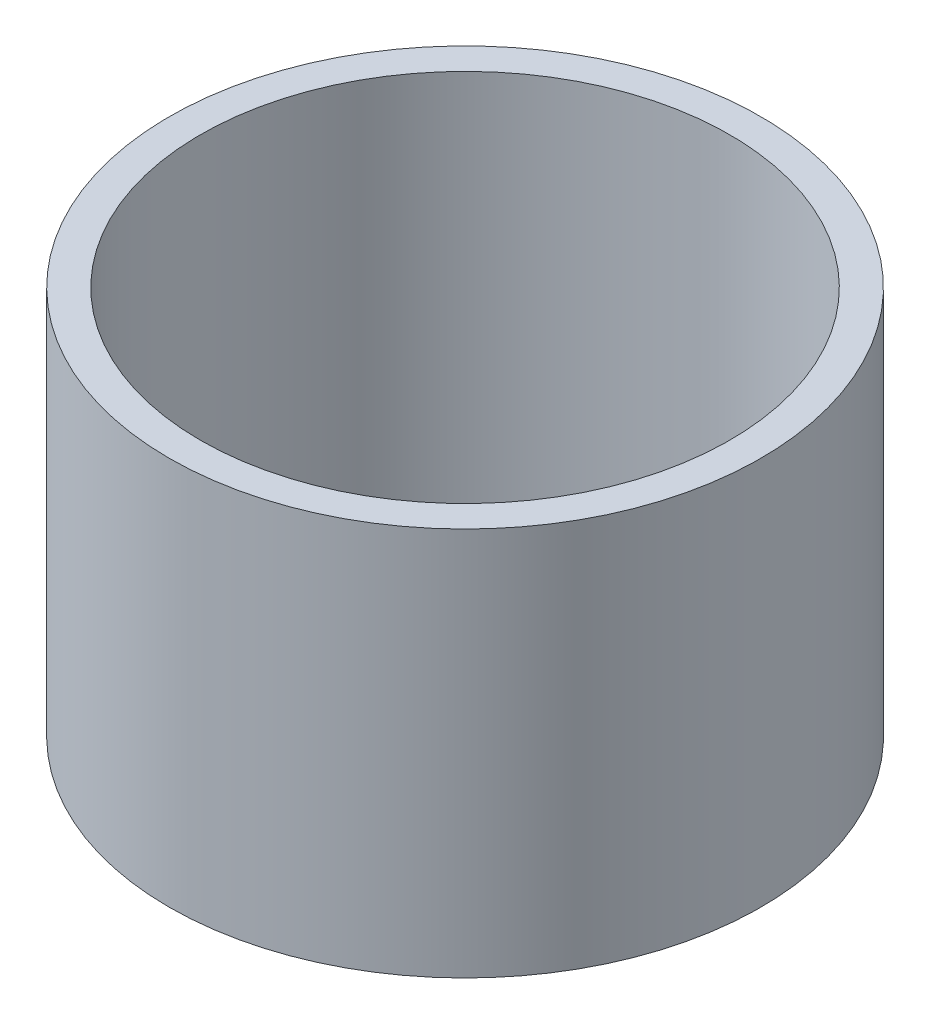
ISO-10303-21;
HEADER;
FILE_DESCRIPTION(('STEP AP214'),'2;1');
FILE_NAME('part.step','',(''),(''),'','','');
FILE_SCHEMA(('AUTOMOTIVE_DESIGN { 1 0 10303 214 1 1 1 1 }'));
ENDSEC;
DATA;
#1=APPLICATION_CONTEXT('core data for automotive mechanical design processes');
#2=APPLICATION_PROTOCOL_DEFINITION('international standard','automotive_design',2000,#1);
#3=PRODUCT_CONTEXT('',#1,'mechanical');
#4=PRODUCT('Part','Part','',(#3));
#5=PRODUCT_RELATED_PRODUCT_CATEGORY('part','',(#4));
#6=PRODUCT_DEFINITION_FORMATION('','',#4);
#7=PRODUCT_DEFINITION_CONTEXT('part definition',#1,'design');
#8=PRODUCT_DEFINITION('design','',#6,#7);
#9=PRODUCT_DEFINITION_SHAPE('','',#8);
#10=(LENGTH_UNIT() NAMED_UNIT(*) SI_UNIT(.MILLI.,.METRE.));
#11=(NAMED_UNIT(*) PLANE_ANGLE_UNIT() SI_UNIT($,.RADIAN.));
#12=(NAMED_UNIT(*) SI_UNIT($,.STERADIAN.) SOLID_ANGLE_UNIT());
#13=UNCERTAINTY_MEASURE_WITH_UNIT(LENGTH_MEASURE(1.E-05),#10,'distance_accuracy_value','');
#14=(GEOMETRIC_REPRESENTATION_CONTEXT(3) GLOBAL_UNCERTAINTY_ASSIGNED_CONTEXT((#13)) GLOBAL_UNIT_ASSIGNED_CONTEXT((#10,
#11,#12)) REPRESENTATION_CONTEXT('',''));
#15=CARTESIAN_POINT('',(0.,0.,0.));
#16=DIRECTION('',(0.,0.,1.));
#17=DIRECTION('',(1.,0.,0.));
#18=AXIS2_PLACEMENT_3D('',#15,#16,#17);
#19=CARTESIAN_POINT('',(0.,45.9991285574089,0.));
#20=DIRECTION('',(0.,-1.,0.));
#21=DIRECTION('',(0.,0.,-1.));
#22=AXIS2_PLACEMENT_3D('',#19,#20,#21);
#23=CYLINDRICAL_SURFACE('',#22,35.);
#24=CARTESIAN_POINT('',(0.,45.9991285574089,0.));
#25=DIRECTION('',(0.,1.,0.));
#26=DIRECTION('',(0.,0.,1.));
#27=AXIS2_PLACEMENT_3D('',#24,#25,#26);
#28=CIRCLE('',#27,35.);
#29=CARTESIAN_POINT('',(0.,45.9991285574089,35.));
#30=VERTEX_POINT('',#29);
#31=EDGE_CURVE('E10',#30,#30,#28,.T.);
#32=ORIENTED_EDGE('',*,*,#31,.F.);
#33=EDGE_LOOP('',(#32));
#34=FACE_BOUND('',#33,.T.);
#35=CARTESIAN_POINT('',(0.,0.,0.));
#36=DIRECTION('',(0.,1.,0.));
#37=DIRECTION('',(0.,0.,1.));
#38=AXIS2_PLACEMENT_3D('',#35,#36,#37);
#39=CIRCLE('',#38,35.);
#40=CARTESIAN_POINT('',(0.,0.,35.));
#41=VERTEX_POINT('',#40);
#42=EDGE_CURVE('E37',#41,#41,#39,.T.);
#43=ORIENTED_EDGE('',*,*,#42,.T.);
#44=EDGE_LOOP('',(#43));
#45=FACE_BOUND('',#44,.T.);
#46=ADVANCED_FACE('F40',(#34,#45),#23,.T.);
#47=CARTESIAN_POINT('',(0.,45.9991285574089,0.));
#48=DIRECTION('',(0.,1.,0.));
#49=DIRECTION('',(0.,0.,1.));
#50=AXIS2_PLACEMENT_3D('',#47,#48,#49);
#51=PLANE('',#50);
#52=CARTESIAN_POINT('',(0.,45.9991285574089,0.));
#53=DIRECTION('',(0.,1.,0.));
#54=DIRECTION('',(0.,0.,1.));
#55=AXIS2_PLACEMENT_3D('',#52,#53,#54);
#56=CIRCLE('',#55,31.310109406772);
#57=CARTESIAN_POINT('',(0.,45.9991285574089,31.310109406772));
#58=VERTEX_POINT('',#57);
#59=EDGE_CURVE('E50',#58,#58,#56,.T.);
#60=ORIENTED_EDGE('',*,*,#59,.F.);
#61=EDGE_LOOP('',(#60));
#62=FACE_BOUND('',#61,.T.);
#63=ORIENTED_EDGE('',*,*,#31,.T.);
#64=EDGE_LOOP('',(#63));
#65=FACE_BOUND('',#64,.T.);
#66=ADVANCED_FACE('F59',(#62,#65),#51,.T.);
#67=CARTESIAN_POINT('',(0.,0.,0.));
#68=DIRECTION('',(0.,1.,0.));
#69=DIRECTION('',(0.,0.,1.));
#70=AXIS2_PLACEMENT_3D('',#67,#68,#69);
#71=PLANE('',#70);
#72=CARTESIAN_POINT('',(0.,0.,0.));
#73=DIRECTION('',(0.,1.,0.));
#74=DIRECTION('',(0.,0.,1.));
#75=AXIS2_PLACEMENT_3D('',#72,#73,#74);
#76=CIRCLE('',#75,31.310109406772);
#77=CARTESIAN_POINT('',(0.,0.,31.310109406772));
#78=VERTEX_POINT('',#77);
#79=EDGE_CURVE('E47',#78,#78,#76,.T.);
#80=ORIENTED_EDGE('',*,*,#79,.T.);
#81=EDGE_LOOP('',(#80));
#82=FACE_BOUND('',#81,.T.);
#83=ORIENTED_EDGE('',*,*,#42,.F.);
#84=EDGE_LOOP('',(#83));
#85=FACE_BOUND('',#84,.T.);
#86=ADVANCED_FACE('F58',(#82,#85),#71,.F.);
#87=CARTESIAN_POINT('',(0.,45.9991285574089,0.));
#88=DIRECTION('',(0.,-1.,0.));
#89=DIRECTION('',(0.,0.,-1.));
#90=AXIS2_PLACEMENT_3D('',#87,#88,#89);
#91=CYLINDRICAL_SURFACE('',#90,31.310109406772);
#92=ORIENTED_EDGE('',*,*,#59,.T.);
#93=EDGE_LOOP('',(#92));
#94=FACE_BOUND('',#93,.T.);
#95=ORIENTED_EDGE('',*,*,#79,.F.);
#96=EDGE_LOOP('',(#95));
#97=FACE_BOUND('',#96,.T.);
#98=ADVANCED_FACE('F54',(#94,#97),#91,.F.);
#99=CLOSED_SHELL('',(#46,#66,#86,#98));
#100=MANIFOLD_SOLID_BREP('B2',#99);
#101=ADVANCED_BREP_SHAPE_REPRESENTATION('',(#18,#100),#14);
#102=SHAPE_DEFINITION_REPRESENTATION(#9,#101);
ENDSEC;
END-ISO-10303-21;
